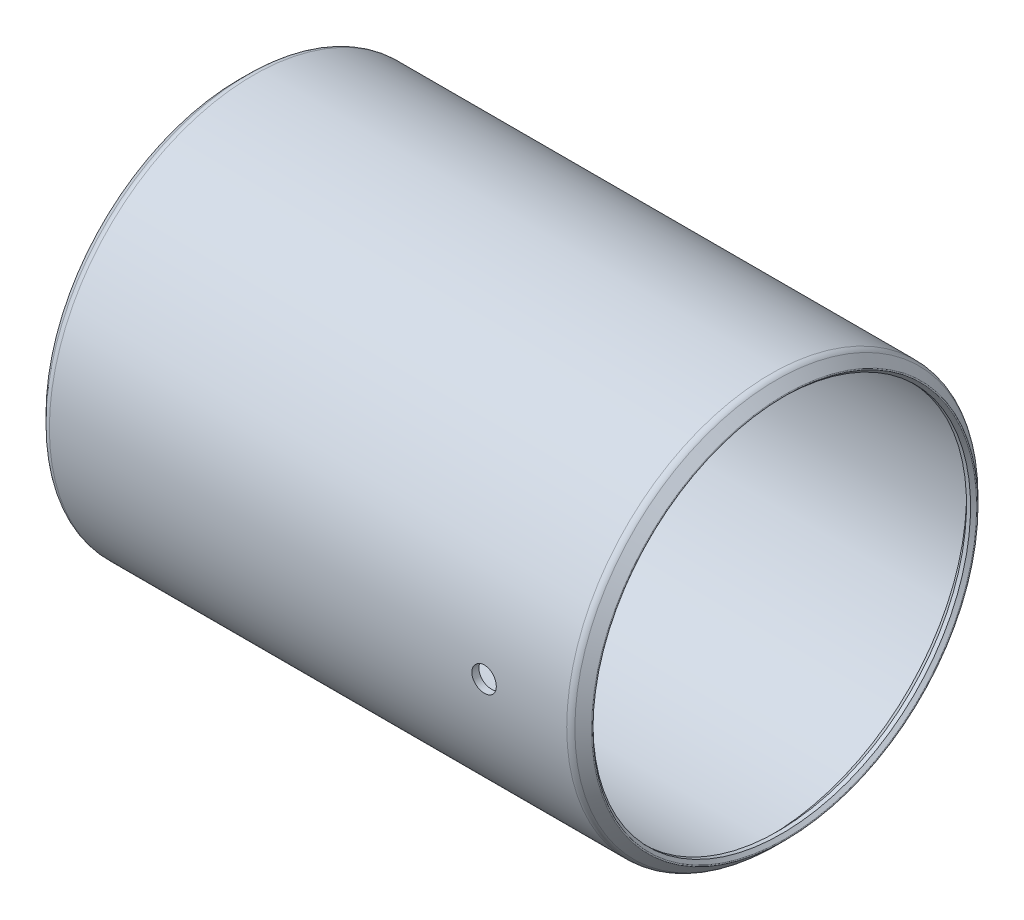
ISO-10303-21;
HEADER;
FILE_DESCRIPTION(('STEP AP214'),'2;1');
FILE_NAME('part.step','',(''),(''),'','','');
FILE_SCHEMA(('AUTOMOTIVE_DESIGN { 1 0 10303 214 1 1 1 1 }'));
ENDSEC;
DATA;
#1=APPLICATION_CONTEXT('core data for automotive mechanical design processes');
#2=APPLICATION_PROTOCOL_DEFINITION('international standard','automotive_design',2000,#1);
#3=PRODUCT_CONTEXT('',#1,'mechanical');
#4=PRODUCT('Part','Part','',(#3));
#5=PRODUCT_RELATED_PRODUCT_CATEGORY('part','',(#4));
#6=PRODUCT_DEFINITION_FORMATION('','',#4);
#7=PRODUCT_DEFINITION_CONTEXT('part definition',#1,'design');
#8=PRODUCT_DEFINITION('design','',#6,#7);
#9=PRODUCT_DEFINITION_SHAPE('','',#8);
#10=(LENGTH_UNIT() NAMED_UNIT(*) SI_UNIT(.MILLI.,.METRE.));
#11=(NAMED_UNIT(*) PLANE_ANGLE_UNIT() SI_UNIT($,.RADIAN.));
#12=(NAMED_UNIT(*) SI_UNIT($,.STERADIAN.) SOLID_ANGLE_UNIT());
#13=UNCERTAINTY_MEASURE_WITH_UNIT(LENGTH_MEASURE(1.E-05),#10,'distance_accuracy_value','');
#14=(GEOMETRIC_REPRESENTATION_CONTEXT(3) GLOBAL_UNCERTAINTY_ASSIGNED_CONTEXT((#13)) GLOBAL_UNIT_ASSIGNED_CONTEXT((#10,
#11,#12)) REPRESENTATION_CONTEXT('',''));
#15=CARTESIAN_POINT('',(0.,0.,0.));
#16=DIRECTION('',(0.,0.,1.));
#17=DIRECTION('',(1.,0.,0.));
#18=AXIS2_PLACEMENT_3D('',#15,#16,#17);
#19=CARTESIAN_POINT('',(69.0118,0.,0.));
#20=DIRECTION('',(-1.,0.,0.));
#21=DIRECTION('',(0.,0.,1.));
#22=AXIS2_PLACEMENT_3D('',#19,#20,#21);
#23=CYLINDRICAL_SURFACE('',#22,25.57145);
#24=CARTESIAN_POINT('',(1.0541,0.,0.));
#25=DIRECTION('',(-1.,0.,0.));
#26=DIRECTION('',(0.,0.,1.));
#27=AXIS2_PLACEMENT_3D('',#24,#25,#26);
#28=CIRCLE('',#27,25.57145);
#29=CARTESIAN_POINT('',(1.0541,0.,25.57145));
#30=VERTEX_POINT('',#29);
#31=EDGE_CURVE('E56',#30,#30,#28,.T.);
#32=ORIENTED_EDGE('',*,*,#31,.T.);
#33=EDGE_LOOP('',(#32));
#34=FACE_BOUND('',#33,.T.);
#35=CARTESIAN_POINT('',(67.9577,0.,0.));
#36=DIRECTION('',(-1.,0.,0.));
#37=DIRECTION('',(0.,0.,1.));
#38=AXIS2_PLACEMENT_3D('',#35,#36,#37);
#39=CIRCLE('',#38,25.57145);
#40=CARTESIAN_POINT('',(67.9577,0.,25.57145));
#41=VERTEX_POINT('',#40);
#42=EDGE_CURVE('E59',#41,#41,#39,.T.);
#43=ORIENTED_EDGE('',*,*,#42,.F.);
#44=EDGE_LOOP('',(#43));
#45=FACE_BOUND('',#44,.T.);
#46=CARTESIAN_POINT('',(58.9534,0.,25.57145));
#47=CARTESIAN_POINT('',(58.9533960800923,-0.0890785264665203,25.5714493447716));
#48=CARTESIAN_POINT('',(58.9458771837364,-0.178219454826774,25.5709795623505));
#49=CARTESIAN_POINT('',(58.9159906890871,-0.354040013814786,25.5691506713592));
#50=CARTESIAN_POINT('',(58.8936058003499,-0.440716655702507,25.5677905272471));
#51=CARTESIAN_POINT('',(58.8346326677164,-0.609036416633367,25.5643347845169));
#52=CARTESIAN_POINT('',(58.7980519067132,-0.69068216132043,25.5622395734213));
#53=CARTESIAN_POINT('',(58.7117375297746,-0.846653095066667,25.5575493611547));
#54=CARTESIAN_POINT('',(58.662006929516,-0.920979957221841,25.5549544746122));
#55=CARTESIAN_POINT('',(58.5507238638662,-1.06033460911293,25.5495523034618));
#56=CARTESIAN_POINT('',(58.489156065411,-1.12535014491725,25.5467447462656));
#57=CARTESIAN_POINT('',(58.3559778526818,-1.24413181337361,25.5412359896133));
#58=CARTESIAN_POINT('',(58.2843670193243,-1.29789747634882,25.5385347946017));
#59=CARTESIAN_POINT('',(58.1330662690385,-1.39269082770399,25.5335412842431));
#60=CARTESIAN_POINT('',(58.0533699736334,-1.43370835402017,25.5312492957076));
#61=CARTESIAN_POINT('',(57.8882053075456,-1.50177606410441,25.5273361885206));
#62=CARTESIAN_POINT('',(57.8027369982689,-1.52882639643714,25.5257150627334));
#63=CARTESIAN_POINT('',(57.628572334744,-1.568157895832,25.5233290878996));
#64=CARTESIAN_POINT('',(57.5398803254064,-1.58045823417964,25.5225631274425));
#65=CARTESIAN_POINT('',(57.3616873992574,-1.58999976422782,25.521970531941));
#66=CARTESIAN_POINT('',(57.2721864915153,-1.58724112456086,25.522143886378));
#67=CARTESIAN_POINT('',(57.0950469925509,-1.56675891829479,25.523409339604));
#68=CARTESIAN_POINT('',(57.0074059922458,-1.54905609692806,25.5245001647696));
#69=CARTESIAN_POINT('',(56.8363419336435,-1.49922022152947,25.5274756237116));
#70=CARTESIAN_POINT('',(56.7529189003468,-1.4670870819784,25.5293602621923));
#71=CARTESIAN_POINT('',(56.5925921996034,-1.3892791567144,25.5337124255201));
#72=CARTESIAN_POINT('',(56.5156931114878,-1.34359495865048,25.5361803552692));
#73=CARTESIAN_POINT('',(56.3706472511375,-1.23998854625602,25.5414205740083));
#74=CARTESIAN_POINT('',(56.3025005759537,-1.18206619624176,25.5441928663726));
#75=CARTESIAN_POINT('',(56.1767732738258,-1.05551083369737,25.5497350451122));
#76=CARTESIAN_POINT('',(56.1192107173303,-0.986859866887193,25.5525049194825));
#77=CARTESIAN_POINT('',(56.0164250239797,-0.840858968683622,25.5577256050605));
#78=CARTESIAN_POINT('',(55.9712018913823,-0.763509034288758,25.560176416158));
#79=CARTESIAN_POINT('',(55.8943803030942,-0.602294938215074,25.564482995108));
#80=CARTESIAN_POINT('',(55.8627825298126,-0.518430450511195,25.5663387331558));
#81=CARTESIAN_POINT('',(55.8141206674,-0.34657274273392,25.56924564687));
#82=CARTESIAN_POINT('',(55.7970564107983,-0.258579570248,25.5702968318073));
#83=CARTESIAN_POINT('',(55.7779683605088,-0.0811190864972094,25.5714749918259));
#84=CARTESIAN_POINT('',(55.7759195824085,0.00834552764598568,25.571603502148));
#85=CARTESIAN_POINT('',(55.7868553690338,0.186347157410752,25.5709259148492));
#86=CARTESIAN_POINT('',(55.7998398565871,0.274884177791705,25.5701198220261));
#87=CARTESIAN_POINT('',(55.8404529056559,0.448447007435653,25.5676647643642));
#88=CARTESIAN_POINT('',(55.8680700063826,0.533475508595245,25.5660164592125));
#89=CARTESIAN_POINT('',(55.9371526936012,0.697690729990357,25.562062422209));
#90=CARTESIAN_POINT('',(55.9786184029977,0.776877398372753,25.5597566845228));
#91=CARTESIAN_POINT('',(56.0742848618106,0.92727555718359,25.5547430503514));
#92=CARTESIAN_POINT('',(56.1285022999295,0.998476414358508,25.5520346285808));
#93=CARTESIAN_POINT('',(56.2481088867885,1.13077478120164,25.5465221980211));
#94=CARTESIAN_POINT('',(56.3134981440946,1.19187219267486,25.5437181883034));
#95=CARTESIAN_POINT('',(56.4536999871315,1.30231394947933,25.5383261710364));
#96=CARTESIAN_POINT('',(56.5285253529806,1.35164208760784,25.5357384645008));
#97=CARTESIAN_POINT('',(56.6854111462359,1.43703419209743,25.5310756619567));
#98=CARTESIAN_POINT('',(56.767471529506,1.47309823936686,25.5290005628214));
#99=CARTESIAN_POINT('',(56.9364387345417,1.530910364964,25.5255991585257));
#100=CARTESIAN_POINT('',(57.0233420532342,1.55266864904231,25.5242723196518));
#101=CARTESIAN_POINT('',(57.1995769402625,1.58128494366194,25.522515584211));
#102=CARTESIAN_POINT('',(57.2889084848735,1.58814309973038,25.5220856788837));
#103=CARTESIAN_POINT('',(57.4673028641642,1.58676305768005,25.5221715035137));
#104=CARTESIAN_POINT('',(57.5563658978509,1.57855034051779,25.5226856373453));
#105=CARTESIAN_POINT('',(57.7318457992229,1.54731450354691,25.5245982218144));
#106=CARTESIAN_POINT('',(57.8182626621029,1.52429135684587,25.5259966740576));
#107=CARTESIAN_POINT('',(57.9860010689119,1.46409391711999,25.5295199119532));
#108=CARTESIAN_POINT('',(58.0673226461441,1.42691971659899,25.5316446928577));
#109=CARTESIAN_POINT('',(58.2225734420452,1.33947894953243,25.5363811045386));
#110=CARTESIAN_POINT('',(58.2965028534327,1.2892127244278,25.5389927226177));
#111=CARTESIAN_POINT('',(58.4349998743928,1.17692069068622,25.5444136474425));
#112=CARTESIAN_POINT('',(58.4995525547836,1.11487648424476,25.5472232590882));
#113=CARTESIAN_POINT('',(58.6173483947497,0.980813965322818,25.5527209869188));
#114=CARTESIAN_POINT('',(58.6705887828363,0.90879321573264,25.5554090732036));
#115=CARTESIAN_POINT('',(58.7642874112872,0.756740965553976,25.5603636031448));
#116=CARTESIAN_POINT('',(58.8047298909716,0.676699746126725,25.5626295255039));
#117=CARTESIAN_POINT('',(58.8715525493497,0.511007368356208,25.5664773734879));
#118=CARTESIAN_POINT('',(58.8979492026055,0.425362915184585,25.5680601000301));
#119=CARTESIAN_POINT('',(58.9290678943832,0.282661836612508,25.5699483183568));
#120=CARTESIAN_POINT('',(58.9381806406946,0.226527688897208,25.5705089473229));
#121=CARTESIAN_POINT('',(58.9503479394458,0.113604155135488,25.5712599968465));
#122=CARTESIAN_POINT('',(58.9534025001385,0.0568147699817819,25.5714504179083));
#123=CARTESIAN_POINT('',(58.9534,0.,25.57145));
#124=B_SPLINE_CURVE_WITH_KNOTS('',3,(#46,#47,#48,#49,#50,#51,#52,#53,#54,#55,#56,#57,#58,#59,
#60,#61,#62,#63,#64,#65,#66,#67,#68,#69,#70,#71,#72,#73,#74,#75,#76,#77,#78,#79,#80,#81,#82,#83,
#84,#85,#86,#87,#88,#89,#90,#91,#92,#93,#94,#95,#96,#97,#98,#99,#100,#101,#102,#103,#104,#105,
#106,#107,#108,#109,#110,#111,#112,#113,#114,#115,#116,#117,#118,#119,#120,#121,#122,#123),
.UNSPECIFIED.,.T.,.F.,(4,2,2,2,2,2,2,2,2,2,2,2,2,2,2,2,2,2,2,2,2,2,2,2,2,2,2,2,2,2,2,2,2,2,2,2,
2,2,4),(0.,0.267028172209843,0.534367466644888,0.801566032845921,1.06870337497601,
1.33618910794715,1.60368600609295,1.87139559332503,2.1391023329554,2.40646074264499,
2.67381615842455,2.94080104559105,3.20778751502617,3.47495986502432,3.74213517730278,
4.00976249082371,4.27738989668639,4.54503070477631,4.81266842877918,5.07986072624103,
5.34705165209622,5.61403361309798,5.88101794359301,6.1483536508953,6.41569195627032,
6.68339630943289,6.9510990296241,7.2186105625155,7.48611948265367,7.75317653091146,
8.02023406408666,8.28728985156709,8.55433867491109,8.82180812667263,9.08934303254096,
9.35720613805457,9.62475436644668,9.79506662296589,9.96537864747451),.UNSPECIFIED.);
#125=CARTESIAN_POINT('',(58.9534,0.,25.57145));
#126=VERTEX_POINT('',#125);
#127=EDGE_CURVE('E89',#126,#126,#124,.T.);
#128=ORIENTED_EDGE('',*,*,#127,.F.);
#129=EDGE_LOOP('',(#128));
#130=FACE_BOUND('',#129,.T.);
#131=ADVANCED_FACE('F32',(#34,#45,#130),#23,.F.);
#132=CARTESIAN_POINT('',(69.0118,0.,0.));
#133=DIRECTION('',(-1.,0.,0.));
#134=DIRECTION('',(0.,0.,1.));
#135=AXIS2_PLACEMENT_3D('',#132,#133,#134);
#136=CYLINDRICAL_SURFACE('',#135,26.4858499999996);
#137=CARTESIAN_POINT('',(0.914400000001245,0.,0.));
#138=DIRECTION('',(-1.,0.,0.));
#139=DIRECTION('',(0.,0.,1.));
#140=AXIS2_PLACEMENT_3D('',#137,#138,#139);
#141=CIRCLE('',#140,26.4858499999996);
#142=CARTESIAN_POINT('',(0.914400000001245,0.,26.4858499999996));
#143=VERTEX_POINT('',#142);
#144=EDGE_CURVE('E80',#143,#143,#141,.T.);
#145=ORIENTED_EDGE('',*,*,#144,.F.);
#146=EDGE_LOOP('',(#145));
#147=FACE_BOUND('',#146,.T.);
#148=CARTESIAN_POINT('',(68.0973999999988,0.,0.));
#149=DIRECTION('',(-1.,0.,0.));
#150=DIRECTION('',(0.,0.,1.));
#151=AXIS2_PLACEMENT_3D('',#148,#149,#150);
#152=CIRCLE('',#151,26.4858499999997);
#153=CARTESIAN_POINT('',(68.0973999999988,0.,26.4858499999997));
#154=VERTEX_POINT('',#153);
#155=EDGE_CURVE('E77',#154,#154,#152,.T.);
#156=ORIENTED_EDGE('',*,*,#155,.T.);
#157=EDGE_LOOP('',(#156));
#158=FACE_BOUND('',#157,.T.);
#159=CARTESIAN_POINT('',(55.7784,0.,26.4858499999996));
#160=CARTESIAN_POINT('',(55.7784039224482,-0.0890847636068652,26.485849366631));
#161=CARTESIAN_POINT('',(55.785923867461,-0.178232082260465,26.4853957388718));
#162=CARTESIAN_POINT('',(55.8158147705106,-0.35406567322625,26.4836297386879));
#163=CARTESIAN_POINT('',(55.8382030612471,-0.440748949963702,26.4823163640431));
#164=CARTESIAN_POINT('',(55.8971857592813,-0.609082012281831,26.4789794645282));
#165=CARTESIAN_POINT('',(55.933772729361,-0.690734407117927,26.4769563114905));
#166=CARTESIAN_POINT('',(56.0201022979496,-0.846717330622771,26.4724274718941));
#167=CARTESIAN_POINT('',(56.0698418629405,-0.92104954220202,26.4699218966375));
#168=CARTESIAN_POINT('',(56.1811406165443,-1.06040685163511,26.4647060087124));
#169=CARTESIAN_POINT('',(56.2427141866504,-1.12542045531024,26.4619954493892));
#170=CARTESIAN_POINT('',(56.3759036206416,-1.24419681767903,26.4566771991166));
#171=CARTESIAN_POINT('',(56.4475199018247,-1.29795910862302,26.4540695124474));
#172=CARTESIAN_POINT('',(56.5988261104615,-1.392741517496,26.4492492023987));
#173=CARTESIAN_POINT('',(56.6785219688072,-1.43375218383997,26.4470368725741));
#174=CARTESIAN_POINT('',(56.8436834475946,-1.50180669707748,26.4432599214114));
#175=CARTESIAN_POINT('',(56.929149010061,-1.52885068428766,26.4416952935663));
#176=CARTESIAN_POINT('',(57.103313941242,-1.56817251615512,26.4393925183946));
#177=CARTESIAN_POINT('',(57.1920092616153,-1.58046823227929,26.4386533708535));
#178=CARTESIAN_POINT('',(57.3702077886153,-1.58999965482356,26.4380819130149));
#179=CARTESIAN_POINT('',(57.4597109867017,-1.58723552026127,26.4382495931423));
#180=CARTESIAN_POINT('',(57.6368628939427,-1.56674054637503,26.4394719525842));
#181=CARTESIAN_POINT('',(57.7245138486975,-1.54902903946888,26.4405254861598));
#182=CARTESIAN_POINT('',(57.8955963573035,-1.49917206575954,26.4433990176374));
#183=CARTESIAN_POINT('',(57.9790278875283,-1.46702651814383,26.4452190198306));
#184=CARTESIAN_POINT('',(58.1393653800972,-1.38919198078229,26.4494216989329));
#185=CARTESIAN_POINT('',(58.2162670705211,-1.34349421145243,26.4518047403936));
#186=CARTESIAN_POINT('',(58.361315219039,-1.23985879182646,26.4568645696333));
#187=CARTESIAN_POINT('',(58.4294615868601,-1.18192101534449,26.4595413604405));
#188=CARTESIAN_POINT('',(58.5551771534016,-1.05534129153477,26.4648921106866));
#189=CARTESIAN_POINT('',(58.6127295056537,-0.986682610938892,26.4675660590067));
#190=CARTESIAN_POINT('',(58.7154934254551,-0.840668740830279,26.4726057194353));
#191=CARTESIAN_POINT('',(58.7607049890073,-0.763313548500804,26.4749714314438));
#192=CARTESIAN_POINT('',(58.8375024728445,-0.602092348163894,26.479128198581));
#193=CARTESIAN_POINT('',(58.8690877662632,-0.518226040826944,26.4809192272708));
#194=CARTESIAN_POINT('',(58.9177249195988,-0.346367788220348,26.4837244362312));
#195=CARTESIAN_POINT('',(58.9347769356472,-0.25837588728284,26.4847386248475));
#196=CARTESIAN_POINT('',(58.9538426402692,-0.0809103991076027,26.485874791749));
#197=CARTESIAN_POINT('',(58.9558796228579,0.00856067712129428,26.485998152041));
#198=CARTESIAN_POINT('',(58.9449182852274,0.18657327315787,26.4853424354069));
#199=CARTESIAN_POINT('',(58.9319200368792,0.275114797406926,26.4845633627947));
#200=CARTESIAN_POINT('',(58.891276495667,0.448689376783001,26.4821913839784));
#201=CARTESIAN_POINT('',(58.8636418786704,0.533724940516423,26.4805990709877));
#202=CARTESIAN_POINT('',(58.7945208840186,0.69795114561597,26.476779781356));
#203=CARTESIAN_POINT('',(58.7530343917203,0.777141738600426,26.4745527994622));
#204=CARTESIAN_POINT('',(58.6573279218181,0.927536807185121,26.4697110255744));
#205=CARTESIAN_POINT('',(58.6030923739162,0.998731358915672,26.4670957608247));
#206=CARTESIAN_POINT('',(58.4834500235077,1.13101351824133,26.4617733717519));
#207=CARTESIAN_POINT('',(58.4180431195933,1.19210103408004,26.459066246595));
#208=CARTESIAN_POINT('',(58.2778142848882,1.30251387096851,26.4538612607184));
#209=CARTESIAN_POINT('',(58.2029804509007,1.35182408900105,26.4513636713369));
#210=CARTESIAN_POINT('',(58.0460819097408,1.43717930450387,26.4468637183413));
#211=CARTESIAN_POINT('',(57.964017244253,1.47322437843934,26.4448613518725));
#212=CARTESIAN_POINT('',(57.79504189557,1.53099992465248,26.4415796062692));
#213=CARTESIAN_POINT('',(57.7081344816181,1.55273992999961,26.4402997457291));
#214=CARTESIAN_POINT('',(57.531895130786,1.58131936444246,26.4386060035577));
#215=CARTESIAN_POINT('',(57.4425632156727,1.58815892726778,26.4381921141545));
#216=CARTESIAN_POINT('',(57.2641608725811,1.58674205040655,26.4382771767586));
#217=CARTESIAN_POINT('',(57.1750902543434,1.57850935782069,26.4387746928014));
#218=CARTESIAN_POINT('',(56.9995984123893,1.54723086848496,26.440623459395));
#219=CARTESIAN_POINT('',(56.9131771935346,1.52418504455354,26.4419747115124));
#220=CARTESIAN_POINT('',(56.7454334728053,1.46393972762672,26.4453783252566));
#221=CARTESIAN_POINT('',(56.664110953437,1.42674028319559,26.4474306844778));
#222=CARTESIAN_POINT('',(56.5088629299471,1.33924708809902,26.4520051798612));
#223=CARTESIAN_POINT('',(56.4349372264325,1.28895369053354,26.454527303355));
#224=CARTESIAN_POINT('',(56.2964611844989,1.17661287730875,26.4597617154934));
#225=CARTESIAN_POINT('',(56.2319247037669,1.11454839337705,26.4624742766331));
#226=CARTESIAN_POINT('',(56.1141649023504,0.98044824537699,26.4677816264792));
#227=CARTESIAN_POINT('',(56.0609443568325,0.908410142473019,26.4703763861732));
#228=CARTESIAN_POINT('',(55.9672911895776,0.756331358253571,26.4751582378586));
#229=CARTESIAN_POINT('',(55.9268736597449,0.676281377845187,26.4773448474948));
#230=CARTESIAN_POINT('',(55.8601017285571,0.510577096263029,26.4810573935168));
#231=CARTESIAN_POINT('',(55.8337308255262,0.424929504495323,26.4825841047376));
#232=CARTESIAN_POINT('',(55.8026688132919,0.282296746666981,26.4844039147834));
#233=CARTESIAN_POINT('',(55.7935797430571,0.226233980501182,26.4849437927113));
#234=CARTESIAN_POINT('',(55.7814440910617,0.113455934751089,26.4856670367999));
#235=CARTESIAN_POINT('',(55.7783975016796,0.0567406559899069,26.4858504034104));
#236=CARTESIAN_POINT('',(55.7784,0.,26.4858499999996));
#237=B_SPLINE_CURVE_WITH_KNOTS('',3,(#159,#160,#161,#162,#163,#164,#165,#166,#167,#168,#169,
#170,#171,#172,#173,#174,#175,#176,#177,#178,#179,#180,#181,#182,#183,#184,#185,#186,#187,#188,
#189,#190,#191,#192,#193,#194,#195,#196,#197,#198,#199,#200,#201,#202,#203,#204,#205,#206,#207,
#208,#209,#210,#211,#212,#213,#214,#215,#216,#217,#218,#219,#220,#221,#222,#223,#224,#225,#226,
#227,#228,#229,#230,#231,#232,#233,#234,#235,#236),.UNSPECIFIED.,.T.,.F.,(4,2,2,2,2,2,2,2,2,2,2,
2,2,2,2,2,2,2,2,2,2,2,2,2,2,2,2,2,2,2,2,2,2,2,2,2,2,2,4),(0.,0.267047156547606,
0.534406169719341,0.801625329790048,1.06878291203836,1.33626723920897,1.60376268427004,
1.87145592860238,2.13914648349436,2.40651233106032,2.67387535550437,2.94089311081186,
3.20791236110256,3.47510497471763,3.74230034303514,4.00991699916015,4.27753374196448,
4.54516279496107,4.81278897277133,5.07999987325915,5.34720949643845,5.61422448296871,
5.88124167946426,6.14858669145638,6.41593413039836,6.68362259240976,6.95130951134197,
7.21881785934107,7.4863238064765,7.75340864712177,8.02049397785949,8.28757839217543,
8.55465560486698,8.8221230864943,9.0896560874815,9.35750328676868,9.62503512702408,
9.79512537973618,9.96521541791172),.UNSPECIFIED.);
#238=CARTESIAN_POINT('',(55.7784,0.,26.4858499999996));
#239=VERTEX_POINT('',#238);
#240=EDGE_CURVE('E10',#239,#239,#237,.T.);
#241=ORIENTED_EDGE('',*,*,#240,.F.);
#242=EDGE_LOOP('',(#241));
#243=FACE_BOUND('',#242,.T.);
#244=ADVANCED_FACE('F110',(#147,#158,#243),#136,.T.);
#245=CARTESIAN_POINT('',(-0.829281135627824,0.,0.));
#246=DIRECTION('',(-1.,0.,0.));
#247=DIRECTION('',(0.,0.,1.));
#248=AXIS2_PLACEMENT_3D('',#245,#246,#247);
#249=TOROIDAL_SURFACE('',#248,24.9991862580485,0.126999999999535);
#250=CARTESIAN_POINT('',(-0.919083696838047,0.,0.));
#251=DIRECTION('',(-1.,0.,0.));
#252=DIRECTION('',(0.,0.,1.));
#253=AXIS2_PLACEMENT_3D('',#250,#251,#252);
#254=CIRCLE('',#253,24.909383696838);
#255=CARTESIAN_POINT('',(-0.919083696838047,0.,24.909383696838));
#256=VERTEX_POINT('',#255);
#257=EDGE_CURVE('E43',#256,#256,#254,.T.);
#258=ORIENTED_EDGE('',*,*,#257,.F.);
#259=EDGE_LOOP('',(#258));
#260=FACE_BOUND('',#259,.T.);
#261=CARTESIAN_POINT('',(-0.919083696838047,0.,0.));
#262=DIRECTION('',(-1.,0.,0.));
#263=DIRECTION('',(0.,0.,1.));
#264=AXIS2_PLACEMENT_3D('',#261,#262,#263);
#265=CIRCLE('',#264,25.088988819259);
#266=CARTESIAN_POINT('',(-0.919083696838047,0.,25.088988819259));
#267=VERTEX_POINT('',#266);
#268=EDGE_CURVE('E86',#267,#267,#265,.T.);
#269=ORIENTED_EDGE('',*,*,#268,.T.);
#270=EDGE_LOOP('',(#269));
#271=FACE_BOUND('',#270,.T.);
#272=ADVANCED_FACE('F34',(#260,#271),#249,.T.);
#273=CARTESIAN_POINT('',(-0.919083696838047,0.,0.));
#274=DIRECTION('',(-1.,0.,0.));
#275=DIRECTION('',(0.,0.,1.));
#276=AXIS2_PLACEMENT_3D('',#273,#274,#275);
#277=CONICAL_SURFACE('',#276,24.909383696838,0.785398163397391);
#278=CARTESIAN_POINT('',(-0.527050000000001,0.,0.));
#279=DIRECTION('',(-1.,0.,0.));
#280=DIRECTION('',(0.,0.,1.));
#281=AXIS2_PLACEMENT_3D('',#278,#279,#280);
#282=CIRCLE('',#281,24.51735);
#283=CARTESIAN_POINT('',(-0.527050000000001,0.,24.51735));
#284=VERTEX_POINT('',#283);
#285=EDGE_CURVE('E47',#284,#284,#282,.T.);
#286=ORIENTED_EDGE('',*,*,#285,.F.);
#287=EDGE_LOOP('',(#286));
#288=FACE_BOUND('',#287,.T.);
#289=ORIENTED_EDGE('',*,*,#257,.T.);
#290=EDGE_LOOP('',(#289));
#291=FACE_BOUND('',#290,.T.);
#292=ADVANCED_FACE('F159',(#288,#291),#277,.F.);
#293=CARTESIAN_POINT('',(69.0118,0.,0.));
#294=DIRECTION('',(-1.,0.,0.));
#295=DIRECTION('',(0.,0.,1.));
#296=AXIS2_PLACEMENT_3D('',#293,#294,#295);
#297=CYLINDRICAL_SURFACE('',#296,24.51735);
#298=CARTESIAN_POINT('',(0.,0.,0.));
#299=DIRECTION('',(-1.,0.,0.));
#300=DIRECTION('',(0.,0.,1.));
#301=AXIS2_PLACEMENT_3D('',#298,#299,#300);
#302=CIRCLE('',#301,24.51735);
#303=CARTESIAN_POINT('',(0.,0.,24.51735));
#304=VERTEX_POINT('',#303);
#305=EDGE_CURVE('E51',#304,#304,#302,.T.);
#306=ORIENTED_EDGE('',*,*,#305,.F.);
#307=EDGE_LOOP('',(#306));
#308=FACE_BOUND('',#307,.T.);
#309=ORIENTED_EDGE('',*,*,#285,.T.);
#310=EDGE_LOOP('',(#309));
#311=FACE_BOUND('',#310,.T.);
#312=ADVANCED_FACE('F140',(#308,#311),#297,.F.);
#313=CARTESIAN_POINT('',(0.,0.,0.));
#314=DIRECTION('',(1.,0.,0.));
#315=DIRECTION('',(0.,0.,-1.));
#316=AXIS2_PLACEMENT_3D('',#313,#314,#315);
#317=CONICAL_SURFACE('',#316,24.51735,0.785398163397447);
#318=ORIENTED_EDGE('',*,*,#31,.F.);
#319=EDGE_LOOP('',(#318));
#320=FACE_BOUND('',#319,.T.);
#321=ORIENTED_EDGE('',*,*,#305,.T.);
#322=EDGE_LOOP('',(#321));
#323=FACE_BOUND('',#322,.T.);
#324=ADVANCED_FACE('F135',(#320,#323),#317,.F.);
#325=CARTESIAN_POINT('',(67.9577,0.,0.));
#326=DIRECTION('',(-1.,0.,0.));
#327=DIRECTION('',(0.,0.,1.));
#328=AXIS2_PLACEMENT_3D('',#325,#326,#327);
#329=CONICAL_SURFACE('',#328,25.57145,0.785398163397453);
#330=CARTESIAN_POINT('',(69.0118,0.,0.));
#331=DIRECTION('',(-1.,0.,0.));
#332=DIRECTION('',(0.,0.,1.));
#333=AXIS2_PLACEMENT_3D('',#330,#331,#332);
#334=CIRCLE('',#333,24.51735);
#335=CARTESIAN_POINT('',(69.0118,0.,24.51735));
#336=VERTEX_POINT('',#335);
#337=EDGE_CURVE('E62',#336,#336,#334,.T.);
#338=ORIENTED_EDGE('',*,*,#337,.F.);
#339=EDGE_LOOP('',(#338));
#340=FACE_BOUND('',#339,.T.);
#341=ORIENTED_EDGE('',*,*,#42,.T.);
#342=EDGE_LOOP('',(#341));
#343=FACE_BOUND('',#342,.T.);
#344=ADVANCED_FACE('F132',(#340,#343),#329,.F.);
#345=CARTESIAN_POINT('',(69.0118,0.,0.));
#346=DIRECTION('',(-1.,0.,0.));
#347=DIRECTION('',(0.,0.,1.));
#348=AXIS2_PLACEMENT_3D('',#345,#346,#347);
#349=CYLINDRICAL_SURFACE('',#348,24.51735);
#350=CARTESIAN_POINT('',(69.53885,0.,0.));
#351=DIRECTION('',(-1.,0.,0.));
#352=DIRECTION('',(0.,0.,1.));
#353=AXIS2_PLACEMENT_3D('',#350,#351,#352);
#354=CIRCLE('',#353,24.51735);
#355=CARTESIAN_POINT('',(69.53885,0.,24.51735));
#356=VERTEX_POINT('',#355);
#357=EDGE_CURVE('E65',#356,#356,#354,.T.);
#358=ORIENTED_EDGE('',*,*,#357,.F.);
#359=EDGE_LOOP('',(#358));
#360=FACE_BOUND('',#359,.T.);
#361=ORIENTED_EDGE('',*,*,#337,.T.);
#362=EDGE_LOOP('',(#361));
#363=FACE_BOUND('',#362,.T.);
#364=ADVANCED_FACE('F129',(#360,#363),#349,.F.);
#365=CARTESIAN_POINT('',(69.53885,0.,0.));
#366=DIRECTION('',(1.,0.,0.));
#367=DIRECTION('',(0.,0.,-1.));
#368=AXIS2_PLACEMENT_3D('',#365,#366,#367);
#369=CONICAL_SURFACE('',#368,24.51735,0.785398163397444);
#370=CARTESIAN_POINT('',(69.930883696838,0.,0.));
#371=DIRECTION('',(-1.,0.,0.));
#372=DIRECTION('',(0.,0.,1.));
#373=AXIS2_PLACEMENT_3D('',#370,#371,#372);
#374=CIRCLE('',#373,24.909383696838);
#375=CARTESIAN_POINT('',(69.930883696838,0.,24.909383696838));
#376=VERTEX_POINT('',#375);
#377=EDGE_CURVE('E68',#376,#376,#374,.T.);
#378=ORIENTED_EDGE('',*,*,#377,.F.);
#379=EDGE_LOOP('',(#378));
#380=FACE_BOUND('',#379,.T.);
#381=ORIENTED_EDGE('',*,*,#357,.T.);
#382=EDGE_LOOP('',(#381));
#383=FACE_BOUND('',#382,.T.);
#384=ADVANCED_FACE('F125',(#380,#383),#369,.F.);
#385=CARTESIAN_POINT('',(69.8410811356268,0.,0.));
#386=DIRECTION('',(-1.,0.,0.));
#387=DIRECTION('',(0.,0.,1.));
#388=AXIS2_PLACEMENT_3D('',#385,#386,#387);
#389=TOROIDAL_SURFACE('',#388,24.9991862580485,0.127000000000265);
#390=CARTESIAN_POINT('',(69.930883696838,0.,0.));
#391=DIRECTION('',(-1.,0.,0.));
#392=DIRECTION('',(0.,0.,1.));
#393=AXIS2_PLACEMENT_3D('',#390,#391,#392);
#394=CIRCLE('',#393,25.088988819259);
#395=CARTESIAN_POINT('',(69.930883696838,0.,25.088988819259));
#396=VERTEX_POINT('',#395);
#397=EDGE_CURVE('E71',#396,#396,#394,.T.);
#398=ORIENTED_EDGE('',*,*,#397,.F.);
#399=EDGE_LOOP('',(#398));
#400=FACE_BOUND('',#399,.T.);
#401=ORIENTED_EDGE('',*,*,#377,.T.);
#402=EDGE_LOOP('',(#401));
#403=FACE_BOUND('',#402,.T.);
#404=ADVANCED_FACE('F121',(#400,#403),#389,.T.);
#405=CARTESIAN_POINT('',(69.930883696838,0.,0.));
#406=DIRECTION('',(-1.,0.,0.));
#407=DIRECTION('',(0.,0.,1.));
#408=AXIS2_PLACEMENT_3D('',#405,#406,#407);
#409=CONICAL_SURFACE('',#408,25.088988819259,0.785398163397721);
#410=CARTESIAN_POINT('',(68.8427612580505,0.,0.));
#411=DIRECTION('',(-1.,0.,0.));
#412=DIRECTION('',(0.,0.,1.));
#413=AXIS2_PLACEMENT_3D('',#410,#411,#412);
#414=CIRCLE('',#413,26.1771112580471);
#415=CARTESIAN_POINT('',(68.8427612580505,0.,26.1771112580471));
#416=VERTEX_POINT('',#415);
#417=EDGE_CURVE('E74',#416,#416,#414,.T.);
#418=ORIENTED_EDGE('',*,*,#417,.F.);
#419=EDGE_LOOP('',(#418));
#420=FACE_BOUND('',#419,.T.);
#421=ORIENTED_EDGE('',*,*,#397,.T.);
#422=EDGE_LOOP('',(#421));
#423=FACE_BOUND('',#422,.T.);
#424=ADVANCED_FACE('F117',(#420,#423),#409,.T.);
#425=CARTESIAN_POINT('',(68.0973999999988,0.,0.));
#426=DIRECTION('',(-1.,0.,0.));
#427=DIRECTION('',(0.,0.,1.));
#428=AXIS2_PLACEMENT_3D('',#425,#426,#427);
#429=TOROIDAL_SURFACE('',#428,25.4317499999958,1.05410000000395);
#430=ORIENTED_EDGE('',*,*,#155,.F.);
#431=EDGE_LOOP('',(#430));
#432=FACE_BOUND('',#431,.T.);
#433=ORIENTED_EDGE('',*,*,#417,.T.);
#434=EDGE_LOOP('',(#433));
#435=FACE_BOUND('',#434,.T.);
#436=ADVANCED_FACE('F108',(#432,#435),#429,.T.);
#437=CARTESIAN_POINT('',(0.914400000000904,0.,0.));
#438=DIRECTION('',(-1.,0.,0.));
#439=DIRECTION('',(0.,0.,1.));
#440=AXIS2_PLACEMENT_3D('',#437,#438,#439);
#441=TOROIDAL_SURFACE('',#440,25.4317499999972,1.0541000000024);
#442=CARTESIAN_POINT('',(0.169038741950511,0.,0.));
#443=DIRECTION('',(-1.,0.,0.));
#444=DIRECTION('',(0.,0.,1.));
#445=AXIS2_PLACEMENT_3D('',#442,#443,#444);
#446=CIRCLE('',#445,26.1771112580476);
#447=CARTESIAN_POINT('',(0.169038741950511,0.,26.1771112580476));
#448=VERTEX_POINT('',#447);
#449=EDGE_CURVE('E83',#448,#448,#446,.T.);
#450=ORIENTED_EDGE('',*,*,#449,.F.);
#451=EDGE_LOOP('',(#450));
#452=FACE_BOUND('',#451,.T.);
#453=ORIENTED_EDGE('',*,*,#144,.T.);
#454=EDGE_LOOP('',(#453));
#455=FACE_BOUND('',#454,.T.);
#456=ADVANCED_FACE('F105',(#452,#455),#441,.T.);
#457=CARTESIAN_POINT('',(0.169038741950511,0.,0.));
#458=DIRECTION('',(1.,0.,0.));
#459=DIRECTION('',(0.,0.,-1.));
#460=AXIS2_PLACEMENT_3D('',#457,#458,#459);
#461=CONICAL_SURFACE('',#460,26.1771112580476,0.785398163397455);
#462=ORIENTED_EDGE('',*,*,#268,.F.);
#463=EDGE_LOOP('',(#462));
#464=FACE_BOUND('',#463,.T.);
#465=ORIENTED_EDGE('',*,*,#449,.T.);
#466=EDGE_LOOP('',(#465));
#467=FACE_BOUND('',#466,.T.);
#468=ADVANCED_FACE('F101',(#464,#467),#461,.T.);
#469=CARTESIAN_POINT('',(57.3659,0.,26.48585));
#470=DIRECTION('',(0.,0.,-1.));
#471=DIRECTION('',(-1.,0.,0.));
#472=AXIS2_PLACEMENT_3D('',#469,#470,#471);
#473=CYLINDRICAL_SURFACE('',#472,1.5875);
#474=ORIENTED_EDGE('',*,*,#240,.T.);
#475=EDGE_LOOP('',(#474));
#476=FACE_BOUND('',#475,.T.);
#477=ORIENTED_EDGE('',*,*,#127,.T.);
#478=EDGE_LOOP('',(#477));
#479=FACE_BOUND('',#478,.T.);
#480=ADVANCED_FACE('F97',(#476,#479),#473,.F.);
#481=CLOSED_SHELL('',(#131,#244,#272,#292,#312,#324,#344,#364,#384,#404,#424,#436,#456,#468,#480));
#482=MANIFOLD_SOLID_BREP('B2',#481);
#483=ADVANCED_BREP_SHAPE_REPRESENTATION('',(#18,#482),#14);
#484=SHAPE_DEFINITION_REPRESENTATION(#9,#483);
ENDSEC;
END-ISO-10303-21;
